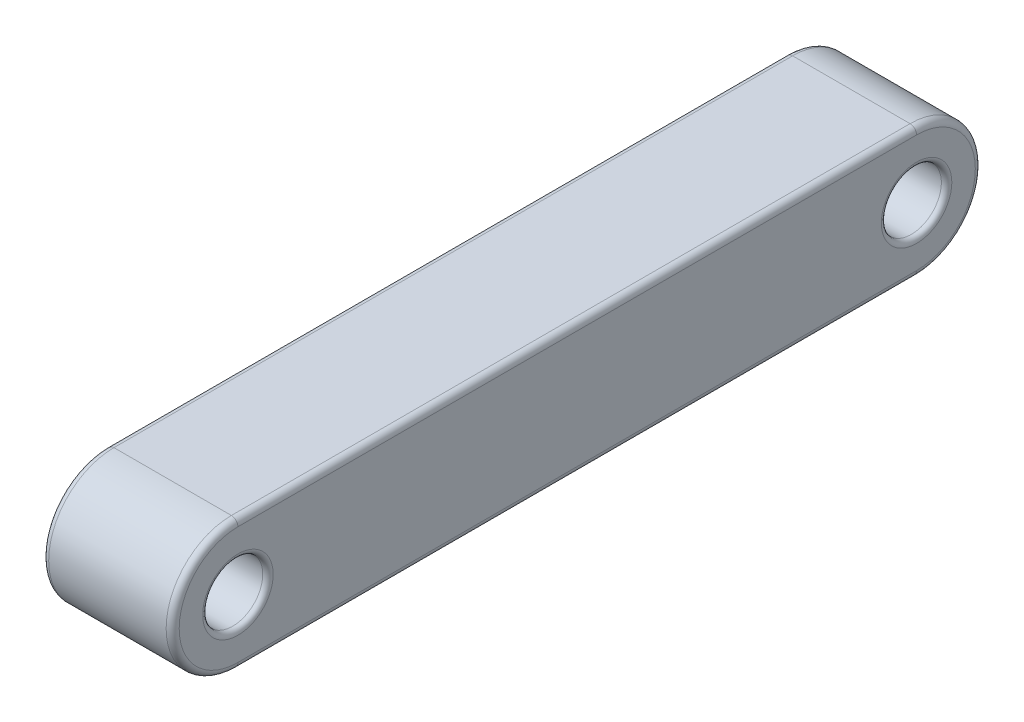
ISO-10303-21;
HEADER;
FILE_DESCRIPTION(('STEP AP214'),'2;1');
FILE_NAME('part.step','',(''),(''),'','','');
FILE_SCHEMA(('AUTOMOTIVE_DESIGN { 1 0 10303 214 1 1 1 1 }'));
ENDSEC;
DATA;
#1=APPLICATION_CONTEXT('core data for automotive mechanical design processes');
#2=APPLICATION_PROTOCOL_DEFINITION('international standard','automotive_design',2000,#1);
#3=PRODUCT_CONTEXT('',#1,'mechanical');
#4=PRODUCT('Part','Part','',(#3));
#5=PRODUCT_RELATED_PRODUCT_CATEGORY('part','',(#4));
#6=PRODUCT_DEFINITION_FORMATION('','',#4);
#7=PRODUCT_DEFINITION_CONTEXT('part definition',#1,'design');
#8=PRODUCT_DEFINITION('design','',#6,#7);
#9=PRODUCT_DEFINITION_SHAPE('','',#8);
#10=(LENGTH_UNIT() NAMED_UNIT(*) SI_UNIT(.MILLI.,.METRE.));
#11=(NAMED_UNIT(*) PLANE_ANGLE_UNIT() SI_UNIT($,.RADIAN.));
#12=(NAMED_UNIT(*) SI_UNIT($,.STERADIAN.) SOLID_ANGLE_UNIT());
#13=UNCERTAINTY_MEASURE_WITH_UNIT(LENGTH_MEASURE(1.E-05),#10,'distance_accuracy_value','');
#14=(GEOMETRIC_REPRESENTATION_CONTEXT(3) GLOBAL_UNCERTAINTY_ASSIGNED_CONTEXT((#13)) GLOBAL_UNIT_ASSIGNED_CONTEXT((#10,
#11,#12)) REPRESENTATION_CONTEXT('',''));
#15=CARTESIAN_POINT('',(0.,0.,0.));
#16=DIRECTION('',(0.,0.,1.));
#17=DIRECTION('',(1.,0.,0.));
#18=AXIS2_PLACEMENT_3D('',#15,#16,#17);
#19=CARTESIAN_POINT('',(2.5,-1.25,-12.));
#20=DIRECTION('',(-1.,0.,0.));
#21=DIRECTION('',(0.,0.,1.));
#22=AXIS2_PLACEMENT_3D('',#19,#20,#21);
#23=CYLINDRICAL_SURFACE('',#22,1.25);
#24=DIRECTION('',(-1.,0.,0.));
#25=VECTOR('',#24,1.);
#26=CARTESIAN_POINT('',(2.5,0.,-12.));
#27=LINE('',#26,#25);
#28=CARTESIAN_POINT('',(2.375,0.,-12.));
#29=VERTEX_POINT('',#28);
#30=CARTESIAN_POINT('',(0.125,0.,-12.));
#31=VERTEX_POINT('',#30);
#32=EDGE_CURVE('E117',#29,#31,#27,.T.);
#33=ORIENTED_EDGE('',*,*,#32,.F.);
#34=CARTESIAN_POINT('',(2.375,-1.25,-12.));
#35=DIRECTION('',(1.,0.,0.));
#36=DIRECTION('',(0.,0.,-1.));
#37=AXIS2_PLACEMENT_3D('',#34,#35,#36);
#38=CIRCLE('',#37,1.25);
#39=CARTESIAN_POINT('',(2.375,-2.50000000000001,-12.));
#40=VERTEX_POINT('',#39);
#41=EDGE_CURVE('E133',#29,#40,#38,.F.);
#42=ORIENTED_EDGE('',*,*,#41,.T.);
#43=DIRECTION('',(-1.,0.,0.));
#44=VECTOR('',#43,1.);
#45=CARTESIAN_POINT('',(2.5,-2.50000000000001,-12.));
#46=LINE('',#45,#44);
#47=CARTESIAN_POINT('',(0.125,-2.50000000000001,-12.));
#48=VERTEX_POINT('',#47);
#49=EDGE_CURVE('E202',#40,#48,#46,.T.);
#50=ORIENTED_EDGE('',*,*,#49,.T.);
#51=CARTESIAN_POINT('',(0.125,-1.25,-12.));
#52=DIRECTION('',(1.,0.,0.));
#53=DIRECTION('',(0.,0.,-1.));
#54=AXIS2_PLACEMENT_3D('',#51,#52,#53);
#55=CIRCLE('',#54,1.25);
#56=EDGE_CURVE('E136',#48,#31,#55,.T.);
#57=ORIENTED_EDGE('',*,*,#56,.T.);
#58=EDGE_LOOP('',(#33,#42,#50,#57));
#59=FACE_BOUND('',#58,.T.);
#60=ADVANCED_FACE('F47',(#59),#23,.T.);
#61=CARTESIAN_POINT('',(2.5,0.,0.));
#62=DIRECTION('',(0.,1.,0.));
#63=DIRECTION('',(0.,0.,1.));
#64=AXIS2_PLACEMENT_3D('',#61,#62,#63);
#65=PLANE('',#64);
#66=DIRECTION('',(-1.,0.,0.));
#67=VECTOR('',#66,1.);
#68=CARTESIAN_POINT('',(2.5,0.,1.));
#69=LINE('',#68,#67);
#70=CARTESIAN_POINT('',(2.375,0.,1.));
#71=VERTEX_POINT('',#70);
#72=CARTESIAN_POINT('',(0.125,0.,1.));
#73=VERTEX_POINT('',#72);
#74=EDGE_CURVE('E119',#71,#73,#69,.T.);
#75=ORIENTED_EDGE('',*,*,#74,.F.);
#76=DIRECTION('',(0.,0.,-1.));
#77=VECTOR('',#76,1.);
#78=CARTESIAN_POINT('',(2.375,0.,0.));
#79=LINE('',#78,#77);
#80=EDGE_CURVE('E114',#71,#29,#79,.T.);
#81=ORIENTED_EDGE('',*,*,#80,.T.);
#82=ORIENTED_EDGE('',*,*,#32,.T.);
#83=DIRECTION('',(0.,0.,-1.));
#84=VECTOR('',#83,1.);
#85=CARTESIAN_POINT('',(0.125,0.,1.));
#86=LINE('',#85,#84);
#87=EDGE_CURVE('E126',#31,#73,#86,.F.);
#88=ORIENTED_EDGE('',*,*,#87,.T.);
#89=EDGE_LOOP('',(#75,#81,#82,#88));
#90=FACE_BOUND('',#89,.T.);
#91=ADVANCED_FACE('F116',(#90),#65,.T.);
#92=CARTESIAN_POINT('',(2.5,-1.25,0.999999999999999));
#93=DIRECTION('',(-1.,0.,0.));
#94=DIRECTION('',(0.,0.,1.));
#95=AXIS2_PLACEMENT_3D('',#92,#93,#94);
#96=CYLINDRICAL_SURFACE('',#95,1.25);
#97=DIRECTION('',(-1.,0.,0.));
#98=VECTOR('',#97,1.);
#99=CARTESIAN_POINT('',(2.5,-2.5,0.999999999999999));
#100=LINE('',#99,#98);
#101=CARTESIAN_POINT('',(2.375,-2.5,0.999999999999999));
#102=VERTEX_POINT('',#101);
#103=CARTESIAN_POINT('',(0.125,-2.5,0.999999999999999));
#104=VERTEX_POINT('',#103);
#105=EDGE_CURVE('E334',#102,#104,#100,.T.);
#106=ORIENTED_EDGE('',*,*,#105,.F.);
#107=CARTESIAN_POINT('',(2.375,-1.25,0.999999999999999));
#108=DIRECTION('',(1.,0.,0.));
#109=DIRECTION('',(0.,0.,-1.));
#110=AXIS2_PLACEMENT_3D('',#107,#108,#109);
#111=CIRCLE('',#110,1.25);
#112=EDGE_CURVE('E173',#102,#71,#111,.F.);
#113=ORIENTED_EDGE('',*,*,#112,.T.);
#114=ORIENTED_EDGE('',*,*,#74,.T.);
#115=CARTESIAN_POINT('',(0.125,-1.25,0.999999999999999));
#116=DIRECTION('',(1.,0.,0.));
#117=DIRECTION('',(0.,0.,-1.));
#118=AXIS2_PLACEMENT_3D('',#115,#116,#117);
#119=CIRCLE('',#118,1.25);
#120=EDGE_CURVE('E125',#73,#104,#119,.T.);
#121=ORIENTED_EDGE('',*,*,#120,.T.);
#122=EDGE_LOOP('',(#106,#113,#114,#121));
#123=FACE_BOUND('',#122,.T.);
#124=ADVANCED_FACE('F258',(#123),#96,.T.);
#125=CARTESIAN_POINT('',(2.5,-1.25,-12.));
#126=DIRECTION('',(-1.,0.,0.));
#127=DIRECTION('',(0.,0.,1.));
#128=AXIS2_PLACEMENT_3D('',#125,#126,#127);
#129=CYLINDRICAL_SURFACE('',#128,0.575000000000002);
#130=CARTESIAN_POINT('',(0.0999999999999998,-1.25,-12.));
#131=DIRECTION('',(1.,0.,0.));
#132=DIRECTION('',(0.,0.,-1.));
#133=AXIS2_PLACEMENT_3D('',#130,#131,#132);
#134=CIRCLE('',#133,0.575000000000002);
#135=CARTESIAN_POINT('',(0.0999999999999998,-1.25,-12.575));
#136=VERTEX_POINT('',#135);
#137=EDGE_CURVE('E227',#136,#136,#134,.F.);
#138=ORIENTED_EDGE('',*,*,#137,.T.);
#139=EDGE_LOOP('',(#138));
#140=FACE_BOUND('',#139,.T.);
#141=CARTESIAN_POINT('',(2.4,-1.25,-12.));
#142=DIRECTION('',(1.,0.,0.));
#143=DIRECTION('',(0.,0.,-1.));
#144=AXIS2_PLACEMENT_3D('',#141,#142,#143);
#145=CIRCLE('',#144,0.575000000000002);
#146=CARTESIAN_POINT('',(2.4,-1.25,-12.575));
#147=VERTEX_POINT('',#146);
#148=EDGE_CURVE('E223',#147,#147,#145,.T.);
#149=ORIENTED_EDGE('',*,*,#148,.T.);
#150=EDGE_LOOP('',(#149));
#151=FACE_BOUND('',#150,.T.);
#152=ADVANCED_FACE('F303',(#140,#151),#129,.F.);
#153=CARTESIAN_POINT('',(2.5,-2.5,0.));
#154=DIRECTION('',(0.,-1.,0.));
#155=DIRECTION('',(0.,0.,-1.));
#156=AXIS2_PLACEMENT_3D('',#153,#154,#155);
#157=PLANE('',#156);
#158=ORIENTED_EDGE('',*,*,#49,.F.);
#159=DIRECTION('',(0.,0.,1.));
#160=VECTOR('',#159,1.);
#161=CARTESIAN_POINT('',(2.375,-2.5,0.));
#162=LINE('',#161,#160);
#163=EDGE_CURVE('E189',#40,#102,#162,.T.);
#164=ORIENTED_EDGE('',*,*,#163,.T.);
#165=ORIENTED_EDGE('',*,*,#105,.T.);
#166=DIRECTION('',(0.,0.,1.));
#167=VECTOR('',#166,1.);
#168=CARTESIAN_POINT('',(0.125,-2.49999999999999,-12.));
#169=LINE('',#168,#167);
#170=EDGE_CURVE('E186',#104,#48,#169,.F.);
#171=ORIENTED_EDGE('',*,*,#170,.T.);
#172=EDGE_LOOP('',(#158,#164,#165,#171));
#173=FACE_BOUND('',#172,.T.);
#174=ADVANCED_FACE('F305',(#173),#157,.T.);
#175=CARTESIAN_POINT('',(2.5,-1.25,0.999999999999999));
#176=DIRECTION('',(-1.,0.,0.));
#177=DIRECTION('',(0.,0.,1.));
#178=AXIS2_PLACEMENT_3D('',#175,#176,#177);
#179=CYLINDRICAL_SURFACE('',#178,0.575);
#180=CARTESIAN_POINT('',(0.0999999999999998,-1.25,0.999999999999999));
#181=DIRECTION('',(1.,0.,0.));
#182=DIRECTION('',(0.,0.,-1.));
#183=AXIS2_PLACEMENT_3D('',#180,#181,#182);
#184=CIRCLE('',#183,0.575);
#185=CARTESIAN_POINT('',(0.0999999999999998,-1.25,0.424999999999999));
#186=VERTEX_POINT('',#185);
#187=EDGE_CURVE('E11',#186,#186,#184,.F.);
#188=ORIENTED_EDGE('',*,*,#187,.T.);
#189=EDGE_LOOP('',(#188));
#190=FACE_BOUND('',#189,.T.);
#191=CARTESIAN_POINT('',(2.4,-1.25,0.999999999999999));
#192=DIRECTION('',(1.,0.,0.));
#193=DIRECTION('',(0.,0.,-1.));
#194=AXIS2_PLACEMENT_3D('',#191,#192,#193);
#195=CIRCLE('',#194,0.575);
#196=CARTESIAN_POINT('',(2.4,-1.25,0.424999999999999));
#197=VERTEX_POINT('',#196);
#198=EDGE_CURVE('E56',#197,#197,#195,.T.);
#199=ORIENTED_EDGE('',*,*,#198,.T.);
#200=EDGE_LOOP('',(#199));
#201=FACE_BOUND('',#200,.T.);
#202=ADVANCED_FACE('F242',(#190,#201),#179,.F.);
#203=CARTESIAN_POINT('',(2.5,0.,0.));
#204=DIRECTION('',(1.,0.,0.));
#205=DIRECTION('',(0.,0.,-1.));
#206=AXIS2_PLACEMENT_3D('',#203,#204,#205);
#207=PLANE('',#206);
#208=CARTESIAN_POINT('',(2.5,-1.25,-12.));
#209=DIRECTION('',(1.,0.,0.));
#210=DIRECTION('',(0.,0.,-1.));
#211=AXIS2_PLACEMENT_3D('',#208,#209,#210);
#212=CIRCLE('',#211,0.675000000000002);
#213=CARTESIAN_POINT('',(2.5,-1.25,-12.675));
#214=VERTEX_POINT('',#213);
#215=EDGE_CURVE('E235',#214,#214,#212,.F.);
#216=ORIENTED_EDGE('',*,*,#215,.T.);
#217=EDGE_LOOP('',(#216));
#218=FACE_BOUND('',#217,.T.);
#219=CARTESIAN_POINT('',(2.5,-1.25,0.999999999999999));
#220=DIRECTION('',(1.,0.,0.));
#221=DIRECTION('',(0.,0.,-1.));
#222=AXIS2_PLACEMENT_3D('',#219,#220,#221);
#223=CIRCLE('',#222,0.675);
#224=CARTESIAN_POINT('',(2.5,-1.25,0.324999999999999));
#225=VERTEX_POINT('',#224);
#226=EDGE_CURVE('E231',#225,#225,#223,.F.);
#227=ORIENTED_EDGE('',*,*,#226,.T.);
#228=EDGE_LOOP('',(#227));
#229=FACE_BOUND('',#228,.T.);
#230=DIRECTION('',(0.,0.,1.));
#231=VECTOR('',#230,1.);
#232=CARTESIAN_POINT('',(2.5,-2.375,0.));
#233=LINE('',#232,#231);
#234=CARTESIAN_POINT('',(2.5,-2.375,0.999999999999999));
#235=VERTEX_POINT('',#234);
#236=CARTESIAN_POINT('',(2.5,-2.37499999999999,-12.));
#237=VERTEX_POINT('',#236);
#238=EDGE_CURVE('E154',#235,#237,#233,.F.);
#239=ORIENTED_EDGE('',*,*,#238,.T.);
#240=CARTESIAN_POINT('',(2.5,-1.25,-12.));
#241=DIRECTION('',(1.,0.,0.));
#242=DIRECTION('',(0.,0.,-1.));
#243=AXIS2_PLACEMENT_3D('',#240,#241,#242);
#244=CIRCLE('',#243,1.125);
#245=CARTESIAN_POINT('',(2.5,-0.125,-12.));
#246=VERTEX_POINT('',#245);
#247=EDGE_CURVE('E166',#237,#246,#244,.T.);
#248=ORIENTED_EDGE('',*,*,#247,.T.);
#249=DIRECTION('',(0.,0.,-1.));
#250=VECTOR('',#249,1.);
#251=CARTESIAN_POINT('',(2.5,-0.124999999999997,0.));
#252=LINE('',#251,#250);
#253=CARTESIAN_POINT('',(2.5,-0.125000000000001,1.));
#254=VERTEX_POINT('',#253);
#255=EDGE_CURVE('E142',#246,#254,#252,.F.);
#256=ORIENTED_EDGE('',*,*,#255,.T.);
#257=CARTESIAN_POINT('',(2.5,-1.25,0.999999999999999));
#258=DIRECTION('',(1.,0.,0.));
#259=DIRECTION('',(0.,0.,-1.));
#260=AXIS2_PLACEMENT_3D('',#257,#258,#259);
#261=CIRCLE('',#260,1.125);
#262=EDGE_CURVE('E158',#254,#235,#261,.T.);
#263=ORIENTED_EDGE('',*,*,#262,.T.);
#264=EDGE_LOOP('',(#239,#248,#256,#263));
#265=FACE_BOUND('',#264,.T.);
#266=ADVANCED_FACE('F318',(#218,#229,#265),#207,.T.);
#267=CARTESIAN_POINT('',(0.,0.,0.));
#268=DIRECTION('',(1.,0.,0.));
#269=DIRECTION('',(0.,0.,-1.));
#270=AXIS2_PLACEMENT_3D('',#267,#268,#269);
#271=PLANE('',#270);
#272=CARTESIAN_POINT('',(0.,-1.25,-12.));
#273=DIRECTION('',(1.,0.,0.));
#274=DIRECTION('',(0.,0.,-1.));
#275=AXIS2_PLACEMENT_3D('',#272,#273,#274);
#276=CIRCLE('',#275,0.675000000000002);
#277=CARTESIAN_POINT('',(0.,-1.25,-12.675));
#278=VERTEX_POINT('',#277);
#279=EDGE_CURVE('E219',#278,#278,#276,.T.);
#280=ORIENTED_EDGE('',*,*,#279,.T.);
#281=EDGE_LOOP('',(#280));
#282=FACE_BOUND('',#281,.T.);
#283=CARTESIAN_POINT('',(0.,-1.25,0.999999999999999));
#284=DIRECTION('',(1.,0.,0.));
#285=DIRECTION('',(0.,0.,-1.));
#286=AXIS2_PLACEMENT_3D('',#283,#284,#285);
#287=CIRCLE('',#286,0.675);
#288=CARTESIAN_POINT('',(0.,-1.25,0.324999999999999));
#289=VERTEX_POINT('',#288);
#290=EDGE_CURVE('E192',#289,#289,#287,.T.);
#291=ORIENTED_EDGE('',*,*,#290,.T.);
#292=EDGE_LOOP('',(#291));
#293=FACE_BOUND('',#292,.T.);
#294=DIRECTION('',(0.,0.,-1.));
#295=VECTOR('',#294,1.);
#296=CARTESIAN_POINT('',(0.,-0.125,-12.));
#297=LINE('',#296,#295);
#298=CARTESIAN_POINT('',(0.,-0.125000000000001,1.));
#299=VERTEX_POINT('',#298);
#300=CARTESIAN_POINT('',(0.,-0.125,-12.));
#301=VERTEX_POINT('',#300);
#302=EDGE_CURVE('E63',#299,#301,#297,.T.);
#303=ORIENTED_EDGE('',*,*,#302,.T.);
#304=CARTESIAN_POINT('',(0.,-1.25,-12.));
#305=DIRECTION('',(1.,0.,0.));
#306=DIRECTION('',(0.,0.,-1.));
#307=AXIS2_PLACEMENT_3D('',#304,#305,#306);
#308=CIRCLE('',#307,1.125);
#309=CARTESIAN_POINT('',(0.,-2.37499999999999,-12.));
#310=VERTEX_POINT('',#309);
#311=EDGE_CURVE('E183',#301,#310,#308,.F.);
#312=ORIENTED_EDGE('',*,*,#311,.T.);
#313=DIRECTION('',(0.,0.,1.));
#314=VECTOR('',#313,1.);
#315=CARTESIAN_POINT('',(0.,-2.375,0.999999999999999));
#316=LINE('',#315,#314);
#317=CARTESIAN_POINT('',(0.,-2.375,0.999999999999999));
#318=VERTEX_POINT('',#317);
#319=EDGE_CURVE('E176',#310,#318,#316,.T.);
#320=ORIENTED_EDGE('',*,*,#319,.T.);
#321=CARTESIAN_POINT('',(0.,-1.25,0.999999999999999));
#322=DIRECTION('',(1.,0.,0.));
#323=DIRECTION('',(0.,0.,-1.));
#324=AXIS2_PLACEMENT_3D('',#321,#322,#323);
#325=CIRCLE('',#324,1.125);
#326=EDGE_CURVE('E68',#318,#299,#325,.F.);
#327=ORIENTED_EDGE('',*,*,#326,.T.);
#328=EDGE_LOOP('',(#303,#312,#320,#327));
#329=FACE_BOUND('',#328,.T.);
#330=ADVANCED_FACE('F274',(#282,#293,#329),#271,.F.);
#331=CARTESIAN_POINT('',(2.375,-1.25,0.999999999999999));
#332=DIRECTION('',(1.,0.,0.));
#333=DIRECTION('',(0.,0.,-1.));
#334=AXIS2_PLACEMENT_3D('',#331,#332,#333);
#335=TOROIDAL_SURFACE('',#334,1.125,0.125);
#336=CARTESIAN_POINT('',(2.375,-2.375,0.999999999999999));
#337=DIRECTION('',(0.,0.,-1.));
#338=DIRECTION('',(-1.,0.,0.));
#339=AXIS2_PLACEMENT_3D('',#336,#337,#338);
#340=CIRCLE('',#339,0.125);
#341=EDGE_CURVE('E147',#235,#102,#340,.T.);
#342=ORIENTED_EDGE('',*,*,#341,.F.);
#343=ORIENTED_EDGE('',*,*,#262,.F.);
#344=CARTESIAN_POINT('',(2.375,-0.125,1.));
#345=DIRECTION('',(0.,0.,-1.));
#346=DIRECTION('',(-1.,0.,0.));
#347=AXIS2_PLACEMENT_3D('',#344,#345,#346);
#348=CIRCLE('',#347,0.125);
#349=EDGE_CURVE('E199',#71,#254,#348,.T.);
#350=ORIENTED_EDGE('',*,*,#349,.F.);
#351=ORIENTED_EDGE('',*,*,#112,.F.);
#352=EDGE_LOOP('',(#342,#343,#350,#351));
#353=FACE_BOUND('',#352,.T.);
#354=ADVANCED_FACE('F271',(#353),#335,.T.);
#355=CARTESIAN_POINT('',(2.375,-0.124999999999997,0.));
#356=DIRECTION('',(0.,0.,-1.));
#357=DIRECTION('',(0.,1.,0.));
#358=AXIS2_PLACEMENT_3D('',#355,#356,#357);
#359=CYLINDRICAL_SURFACE('',#358,0.125);
#360=ORIENTED_EDGE('',*,*,#349,.T.);
#361=ORIENTED_EDGE('',*,*,#255,.F.);
#362=CARTESIAN_POINT('',(2.375,-0.125,-12.));
#363=DIRECTION('',(0.,0.,-1.));
#364=DIRECTION('',(-1.,0.,0.));
#365=AXIS2_PLACEMENT_3D('',#362,#363,#364);
#366=CIRCLE('',#365,0.125);
#367=EDGE_CURVE('E140',#29,#246,#366,.T.);
#368=ORIENTED_EDGE('',*,*,#367,.F.);
#369=ORIENTED_EDGE('',*,*,#80,.F.);
#370=EDGE_LOOP('',(#360,#361,#368,#369));
#371=FACE_BOUND('',#370,.T.);
#372=ADVANCED_FACE('F141',(#371),#359,.T.);
#373=CARTESIAN_POINT('',(2.375,-2.375,0.));
#374=DIRECTION('',(0.,0.,1.));
#375=DIRECTION('',(0.,-1.,0.));
#376=AXIS2_PLACEMENT_3D('',#373,#374,#375);
#377=CYLINDRICAL_SURFACE('',#376,0.125);
#378=ORIENTED_EDGE('',*,*,#341,.T.);
#379=ORIENTED_EDGE('',*,*,#163,.F.);
#380=CARTESIAN_POINT('',(2.375,-2.37499999999999,-12.));
#381=DIRECTION('',(0.,0.,-1.));
#382=DIRECTION('',(-1.,0.,0.));
#383=AXIS2_PLACEMENT_3D('',#380,#381,#382);
#384=CIRCLE('',#383,0.125);
#385=EDGE_CURVE('E148',#237,#40,#384,.T.);
#386=ORIENTED_EDGE('',*,*,#385,.F.);
#387=ORIENTED_EDGE('',*,*,#238,.F.);
#388=EDGE_LOOP('',(#378,#379,#386,#387));
#389=FACE_BOUND('',#388,.T.);
#390=ADVANCED_FACE('F265',(#389),#377,.T.);
#391=CARTESIAN_POINT('',(2.375,-1.25,-12.));
#392=DIRECTION('',(1.,0.,0.));
#393=DIRECTION('',(0.,0.,-1.));
#394=AXIS2_PLACEMENT_3D('',#391,#392,#393);
#395=TOROIDAL_SURFACE('',#394,1.125,0.125);
#396=ORIENTED_EDGE('',*,*,#367,.T.);
#397=ORIENTED_EDGE('',*,*,#247,.F.);
#398=ORIENTED_EDGE('',*,*,#385,.T.);
#399=ORIENTED_EDGE('',*,*,#41,.F.);
#400=EDGE_LOOP('',(#396,#397,#398,#399));
#401=FACE_BOUND('',#400,.T.);
#402=ADVANCED_FACE('F150',(#401),#395,.T.);
#403=CARTESIAN_POINT('',(0.125,-1.25,0.999999999999999));
#404=DIRECTION('',(1.,0.,0.));
#405=DIRECTION('',(0.,0.,-1.));
#406=AXIS2_PLACEMENT_3D('',#403,#404,#405);
#407=TOROIDAL_SURFACE('',#406,1.125,0.125);
#408=CARTESIAN_POINT('',(0.125,-2.375,0.999999999999999));
#409=DIRECTION('',(0.,0.,-1.));
#410=DIRECTION('',(-1.,0.,0.));
#411=AXIS2_PLACEMENT_3D('',#408,#409,#410);
#412=CIRCLE('',#411,0.125);
#413=EDGE_CURVE('E209',#104,#318,#412,.T.);
#414=ORIENTED_EDGE('',*,*,#413,.F.);
#415=ORIENTED_EDGE('',*,*,#120,.F.);
#416=CARTESIAN_POINT('',(0.125,-0.125000000000001,1.));
#417=DIRECTION('',(0.,0.,-1.));
#418=DIRECTION('',(-1.,0.,0.));
#419=AXIS2_PLACEMENT_3D('',#416,#417,#418);
#420=CIRCLE('',#419,0.125);
#421=EDGE_CURVE('E194',#299,#73,#420,.T.);
#422=ORIENTED_EDGE('',*,*,#421,.F.);
#423=ORIENTED_EDGE('',*,*,#326,.F.);
#424=EDGE_LOOP('',(#414,#415,#422,#423));
#425=FACE_BOUND('',#424,.T.);
#426=ADVANCED_FACE('F264',(#425),#407,.T.);
#427=CARTESIAN_POINT('',(0.125,-0.124999999999997,0.));
#428=DIRECTION('',(0.,0.,1.));
#429=DIRECTION('',(0.,-1.,0.));
#430=AXIS2_PLACEMENT_3D('',#427,#428,#429);
#431=CYLINDRICAL_SURFACE('',#430,0.125);
#432=ORIENTED_EDGE('',*,*,#421,.T.);
#433=ORIENTED_EDGE('',*,*,#87,.F.);
#434=CARTESIAN_POINT('',(0.125,-0.125,-12.));
#435=DIRECTION('',(0.,0.,-1.));
#436=DIRECTION('',(-1.,0.,0.));
#437=AXIS2_PLACEMENT_3D('',#434,#435,#436);
#438=CIRCLE('',#437,0.125);
#439=EDGE_CURVE('E206',#301,#31,#438,.T.);
#440=ORIENTED_EDGE('',*,*,#439,.F.);
#441=ORIENTED_EDGE('',*,*,#302,.F.);
#442=EDGE_LOOP('',(#432,#433,#440,#441));
#443=FACE_BOUND('',#442,.T.);
#444=ADVANCED_FACE('F284',(#443),#431,.T.);
#445=CARTESIAN_POINT('',(0.125,-2.375,0.));
#446=DIRECTION('',(0.,0.,-1.));
#447=DIRECTION('',(0.,1.,0.));
#448=AXIS2_PLACEMENT_3D('',#445,#446,#447);
#449=CYLINDRICAL_SURFACE('',#448,0.125);
#450=ORIENTED_EDGE('',*,*,#413,.T.);
#451=ORIENTED_EDGE('',*,*,#319,.F.);
#452=CARTESIAN_POINT('',(0.125,-2.37499999999999,-12.));
#453=DIRECTION('',(0.,0.,-1.));
#454=DIRECTION('',(-1.,0.,0.));
#455=AXIS2_PLACEMENT_3D('',#452,#453,#454);
#456=CIRCLE('',#455,0.125);
#457=EDGE_CURVE('E203',#48,#310,#456,.T.);
#458=ORIENTED_EDGE('',*,*,#457,.F.);
#459=ORIENTED_EDGE('',*,*,#170,.F.);
#460=EDGE_LOOP('',(#450,#451,#458,#459));
#461=FACE_BOUND('',#460,.T.);
#462=ADVANCED_FACE('F280',(#461),#449,.T.);
#463=CARTESIAN_POINT('',(0.125,-1.25,-12.));
#464=DIRECTION('',(1.,0.,0.));
#465=DIRECTION('',(0.,0.,-1.));
#466=AXIS2_PLACEMENT_3D('',#463,#464,#465);
#467=TOROIDAL_SURFACE('',#466,1.125,0.125);
#468=ORIENTED_EDGE('',*,*,#439,.T.);
#469=ORIENTED_EDGE('',*,*,#56,.F.);
#470=ORIENTED_EDGE('',*,*,#457,.T.);
#471=ORIENTED_EDGE('',*,*,#311,.F.);
#472=EDGE_LOOP('',(#468,#469,#470,#471));
#473=FACE_BOUND('',#472,.T.);
#474=ADVANCED_FACE('F276',(#473),#467,.T.);
#475=CARTESIAN_POINT('',(0.0999999999999998,-1.25,-12.));
#476=DIRECTION('',(1.,0.,0.));
#477=DIRECTION('',(0.,0.,-1.));
#478=AXIS2_PLACEMENT_3D('',#475,#476,#477);
#479=TOROIDAL_SURFACE('',#478,0.675000000000002,0.1);
#480=ORIENTED_EDGE('',*,*,#137,.F.);
#481=EDGE_LOOP('',(#480));
#482=FACE_BOUND('',#481,.T.);
#483=ORIENTED_EDGE('',*,*,#279,.F.);
#484=EDGE_LOOP('',(#483));
#485=FACE_BOUND('',#484,.T.);
#486=ADVANCED_FACE('F279',(#482,#485),#479,.T.);
#487=CARTESIAN_POINT('',(2.4,-1.25,-12.));
#488=DIRECTION('',(1.,0.,0.));
#489=DIRECTION('',(0.,0.,-1.));
#490=AXIS2_PLACEMENT_3D('',#487,#488,#489);
#491=TOROIDAL_SURFACE('',#490,0.675000000000002,0.1);
#492=ORIENTED_EDGE('',*,*,#215,.F.);
#493=EDGE_LOOP('',(#492));
#494=FACE_BOUND('',#493,.T.);
#495=ORIENTED_EDGE('',*,*,#148,.F.);
#496=EDGE_LOOP('',(#495));
#497=FACE_BOUND('',#496,.T.);
#498=ADVANCED_FACE('F250',(#494,#497),#491,.T.);
#499=CARTESIAN_POINT('',(0.0999999999999998,-1.25,0.999999999999999));
#500=DIRECTION('',(1.,0.,0.));
#501=DIRECTION('',(0.,0.,-1.));
#502=AXIS2_PLACEMENT_3D('',#499,#500,#501);
#503=TOROIDAL_SURFACE('',#502,0.675,0.1);
#504=ORIENTED_EDGE('',*,*,#187,.F.);
#505=EDGE_LOOP('',(#504));
#506=FACE_BOUND('',#505,.T.);
#507=ORIENTED_EDGE('',*,*,#290,.F.);
#508=EDGE_LOOP('',(#507));
#509=FACE_BOUND('',#508,.T.);
#510=ADVANCED_FACE('F245',(#506,#509),#503,.T.);
#511=CARTESIAN_POINT('',(2.4,-1.25,0.999999999999999));
#512=DIRECTION('',(1.,0.,0.));
#513=DIRECTION('',(0.,0.,-1.));
#514=AXIS2_PLACEMENT_3D('',#511,#512,#513);
#515=TOROIDAL_SURFACE('',#514,0.675,0.1);
#516=ORIENTED_EDGE('',*,*,#226,.F.);
#517=EDGE_LOOP('',(#516));
#518=FACE_BOUND('',#517,.T.);
#519=ORIENTED_EDGE('',*,*,#198,.F.);
#520=EDGE_LOOP('',(#519));
#521=FACE_BOUND('',#520,.T.);
#522=ADVANCED_FACE('F49',(#518,#521),#515,.T.);
#523=CLOSED_SHELL('',(#60,#91,#124,#152,#174,#202,#266,#330,#354,#372,#390,#402,#426,#444,#462,
#474,#486,#498,#510,#522));
#524=MANIFOLD_SOLID_BREP('B2',#523);
#525=ADVANCED_BREP_SHAPE_REPRESENTATION('',(#18,#524),#14);
#526=SHAPE_DEFINITION_REPRESENTATION(#9,#525);
ENDSEC;
END-ISO-10303-21;
